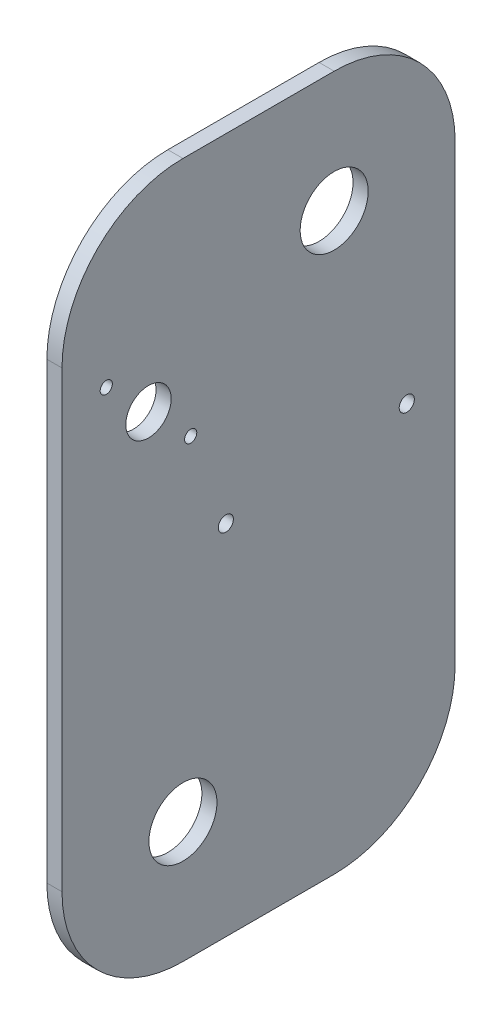
ISO-10303-21;
HEADER;
FILE_DESCRIPTION(('STEP AP214'),'2;1');
FILE_NAME('part.step','',(''),(''),'','','');
FILE_SCHEMA(('AUTOMOTIVE_DESIGN { 1 0 10303 214 1 1 1 1 }'));
ENDSEC;
DATA;
#1=APPLICATION_CONTEXT('core data for automotive mechanical design processes');
#2=APPLICATION_PROTOCOL_DEFINITION('international standard','automotive_design',2000,#1);
#3=PRODUCT_CONTEXT('',#1,'mechanical');
#4=PRODUCT('Part','Part','',(#3));
#5=PRODUCT_RELATED_PRODUCT_CATEGORY('part','',(#4));
#6=PRODUCT_DEFINITION_FORMATION('','',#4);
#7=PRODUCT_DEFINITION_CONTEXT('part definition',#1,'design');
#8=PRODUCT_DEFINITION('design','',#6,#7);
#9=PRODUCT_DEFINITION_SHAPE('','',#8);
#10=(LENGTH_UNIT() NAMED_UNIT(*) SI_UNIT(.MILLI.,.METRE.));
#11=(NAMED_UNIT(*) PLANE_ANGLE_UNIT() SI_UNIT($,.RADIAN.));
#12=(NAMED_UNIT(*) SI_UNIT($,.STERADIAN.) SOLID_ANGLE_UNIT());
#13=UNCERTAINTY_MEASURE_WITH_UNIT(LENGTH_MEASURE(1.E-05),#10,'distance_accuracy_value','');
#14=(GEOMETRIC_REPRESENTATION_CONTEXT(3) GLOBAL_UNCERTAINTY_ASSIGNED_CONTEXT((#13)) GLOBAL_UNIT_ASSIGNED_CONTEXT((#10,
#11,#12)) REPRESENTATION_CONTEXT('',''));
#15=CARTESIAN_POINT('',(0.,0.,0.));
#16=DIRECTION('',(0.,0.,1.));
#17=DIRECTION('',(1.,0.,0.));
#18=AXIS2_PLACEMENT_3D('',#15,#16,#17);
#19=CARTESIAN_POINT('',(3.175,-146.05,-82.55));
#20=DIRECTION('',(0.,0.,1.));
#21=DIRECTION('',(1.,0.,0.));
#22=AXIS2_PLACEMENT_3D('',#19,#20,#21);
#23=PLANE('',#22);
#24=DIRECTION('',(0.,1.,0.));
#25=VECTOR('',#24,1.);
#26=CARTESIAN_POINT('',(3.175,-146.05,-82.55));
#27=LINE('',#26,#25);
#28=CARTESIAN_POINT('',(3.175,-95.25,-82.55));
#29=VERTEX_POINT('',#28);
#30=CARTESIAN_POINT('',(3.175,95.25,-82.55));
#31=VERTEX_POINT('',#30);
#32=EDGE_CURVE('E119',#29,#31,#27,.T.);
#33=ORIENTED_EDGE('',*,*,#32,.F.);
#34=DIRECTION('',(-1.,0.,0.));
#35=VECTOR('',#34,1.);
#36=CARTESIAN_POINT('',(3.175,-95.25,-82.55));
#37=LINE('',#36,#35);
#38=CARTESIAN_POINT('',(-3.175,-95.25,-82.55));
#39=VERTEX_POINT('',#38);
#40=EDGE_CURVE('E104',#29,#39,#37,.T.);
#41=ORIENTED_EDGE('',*,*,#40,.T.);
#42=DIRECTION('',(0.,1.,0.));
#43=VECTOR('',#42,1.);
#44=CARTESIAN_POINT('',(-3.175,-146.05,-82.55));
#45=LINE('',#44,#43);
#46=CARTESIAN_POINT('',(-3.175,95.25,-82.55));
#47=VERTEX_POINT('',#46);
#48=EDGE_CURVE('E116',#39,#47,#45,.T.);
#49=ORIENTED_EDGE('',*,*,#48,.T.);
#50=DIRECTION('',(-1.,0.,0.));
#51=VECTOR('',#50,1.);
#52=CARTESIAN_POINT('',(3.175,95.25,-82.55));
#53=LINE('',#52,#51);
#54=EDGE_CURVE('E121',#47,#31,#53,.F.);
#55=ORIENTED_EDGE('',*,*,#54,.T.);
#56=EDGE_LOOP('',(#33,#41,#49,#55));
#57=FACE_BOUND('',#56,.T.);
#58=ADVANCED_FACE('F34',(#57),#23,.F.);
#59=CARTESIAN_POINT('',(3.175,146.05,82.55));
#60=DIRECTION('',(0.,-1.,0.));
#61=DIRECTION('',(0.,0.,-1.));
#62=AXIS2_PLACEMENT_3D('',#59,#60,#61);
#63=PLANE('',#62);
#64=DIRECTION('',(0.,0.,1.));
#65=VECTOR('',#64,1.);
#66=CARTESIAN_POINT('',(3.175,146.05,82.55));
#67=LINE('',#66,#65);
#68=CARTESIAN_POINT('',(3.175,146.05,-31.75));
#69=VERTEX_POINT('',#68);
#70=CARTESIAN_POINT('',(3.175,146.05,31.75));
#71=VERTEX_POINT('',#70);
#72=EDGE_CURVE('E165',#69,#71,#67,.T.);
#73=ORIENTED_EDGE('',*,*,#72,.F.);
#74=DIRECTION('',(-1.,0.,0.));
#75=VECTOR('',#74,1.);
#76=CARTESIAN_POINT('',(3.175,146.05,-31.75));
#77=LINE('',#76,#75);
#78=CARTESIAN_POINT('',(-3.175,146.05,-31.75));
#79=VERTEX_POINT('',#78);
#80=EDGE_CURVE('E158',#69,#79,#77,.T.);
#81=ORIENTED_EDGE('',*,*,#80,.T.);
#82=DIRECTION('',(0.,0.,1.));
#83=VECTOR('',#82,1.);
#84=CARTESIAN_POINT('',(-3.175,146.05,82.55));
#85=LINE('',#84,#83);
#86=CARTESIAN_POINT('',(-3.175,146.05,31.75));
#87=VERTEX_POINT('',#86);
#88=EDGE_CURVE('E125',#79,#87,#85,.T.);
#89=ORIENTED_EDGE('',*,*,#88,.T.);
#90=DIRECTION('',(-1.,0.,0.));
#91=VECTOR('',#90,1.);
#92=CARTESIAN_POINT('',(3.175,146.05,31.75));
#93=LINE('',#92,#91);
#94=EDGE_CURVE('E156',#87,#71,#93,.F.);
#95=ORIENTED_EDGE('',*,*,#94,.T.);
#96=EDGE_LOOP('',(#73,#81,#89,#95));
#97=FACE_BOUND('',#96,.T.);
#98=ADVANCED_FACE('F163',(#97),#63,.F.);
#99=CARTESIAN_POINT('',(3.175,-146.05,82.55));
#100=DIRECTION('',(0.,0.,-1.));
#101=DIRECTION('',(-1.,0.,0.));
#102=AXIS2_PLACEMENT_3D('',#99,#100,#101);
#103=PLANE('',#102);
#104=DIRECTION('',(0.,-1.,0.));
#105=VECTOR('',#104,1.);
#106=CARTESIAN_POINT('',(3.175,-146.05,82.55));
#107=LINE('',#106,#105);
#108=CARTESIAN_POINT('',(3.175,95.25,82.55));
#109=VERTEX_POINT('',#108);
#110=CARTESIAN_POINT('',(3.175,-95.25,82.55));
#111=VERTEX_POINT('',#110);
#112=EDGE_CURVE('E173',#109,#111,#107,.T.);
#113=ORIENTED_EDGE('',*,*,#112,.F.);
#114=DIRECTION('',(-1.,0.,0.));
#115=VECTOR('',#114,1.);
#116=CARTESIAN_POINT('',(3.175,95.25,82.55));
#117=LINE('',#116,#115);
#118=CARTESIAN_POINT('',(-3.175,95.25,82.55));
#119=VERTEX_POINT('',#118);
#120=EDGE_CURVE('E11',#109,#119,#117,.T.);
#121=ORIENTED_EDGE('',*,*,#120,.T.);
#122=DIRECTION('',(0.,-1.,0.));
#123=VECTOR('',#122,1.);
#124=CARTESIAN_POINT('',(-3.175,-146.05,82.55));
#125=LINE('',#124,#123);
#126=CARTESIAN_POINT('',(-3.175,-95.25,82.55));
#127=VERTEX_POINT('',#126);
#128=EDGE_CURVE('E129',#119,#127,#125,.T.);
#129=ORIENTED_EDGE('',*,*,#128,.T.);
#130=DIRECTION('',(-1.,0.,0.));
#131=VECTOR('',#130,1.);
#132=CARTESIAN_POINT('',(3.175,-95.25,82.55));
#133=LINE('',#132,#131);
#134=EDGE_CURVE('E42',#127,#111,#133,.F.);
#135=ORIENTED_EDGE('',*,*,#134,.T.);
#136=EDGE_LOOP('',(#113,#121,#129,#135));
#137=FACE_BOUND('',#136,.T.);
#138=ADVANCED_FACE('F172',(#137),#103,.F.);
#139=CARTESIAN_POINT('',(3.175,-146.05,82.55));
#140=DIRECTION('',(0.,1.,0.));
#141=DIRECTION('',(0.,0.,1.));
#142=AXIS2_PLACEMENT_3D('',#139,#140,#141);
#143=PLANE('',#142);
#144=DIRECTION('',(0.,0.,-1.));
#145=VECTOR('',#144,1.);
#146=CARTESIAN_POINT('',(-3.175,-146.05,82.55));
#147=LINE('',#146,#145);
#148=CARTESIAN_POINT('',(-3.175,-146.05,31.75));
#149=VERTEX_POINT('',#148);
#150=CARTESIAN_POINT('',(-3.175,-146.05,-31.75));
#151=VERTEX_POINT('',#150);
#152=EDGE_CURVE('E139',#149,#151,#147,.T.);
#153=ORIENTED_EDGE('',*,*,#152,.T.);
#154=DIRECTION('',(-1.,0.,0.));
#155=VECTOR('',#154,1.);
#156=CARTESIAN_POINT('',(3.175,-146.05,-31.75));
#157=LINE('',#156,#155);
#158=CARTESIAN_POINT('',(3.175,-146.05,-31.75));
#159=VERTEX_POINT('',#158);
#160=EDGE_CURVE('E105',#151,#159,#157,.F.);
#161=ORIENTED_EDGE('',*,*,#160,.T.);
#162=DIRECTION('',(0.,0.,-1.));
#163=VECTOR('',#162,1.);
#164=CARTESIAN_POINT('',(3.175,-146.05,82.55));
#165=LINE('',#164,#163);
#166=CARTESIAN_POINT('',(3.175,-146.05,31.75));
#167=VERTEX_POINT('',#166);
#168=EDGE_CURVE('E135',#167,#159,#165,.T.);
#169=ORIENTED_EDGE('',*,*,#168,.F.);
#170=DIRECTION('',(-1.,0.,0.));
#171=VECTOR('',#170,1.);
#172=CARTESIAN_POINT('',(3.175,-146.05,31.75));
#173=LINE('',#172,#171);
#174=EDGE_CURVE('E110',#167,#149,#173,.T.);
#175=ORIENTED_EDGE('',*,*,#174,.T.);
#176=EDGE_LOOP('',(#153,#161,#169,#175));
#177=FACE_BOUND('',#176,.T.);
#178=ADVANCED_FACE('F317',(#177),#143,.F.);
#179=CARTESIAN_POINT('',(3.175,0.,0.));
#180=DIRECTION('',(-1.,0.,0.));
#181=DIRECTION('',(0.,0.,1.));
#182=AXIS2_PLACEMENT_3D('',#179,#180,#181);
#183=PLANE('',#182);
#184=CARTESIAN_POINT('',(3.175,43.4336309512017,28.500964373605));
#185=DIRECTION('',(-1.,0.,0.));
#186=DIRECTION('',(0.,0.,1.));
#187=AXIS2_PLACEMENT_3D('',#184,#185,#186);
#188=CIRCLE('',#187,2.5527);
#189=CARTESIAN_POINT('',(3.175,43.4336309512017,31.053664373605));
#190=VERTEX_POINT('',#189);
#191=EDGE_CURVE('E209',#190,#190,#188,.T.);
#192=ORIENTED_EDGE('',*,*,#191,.T.);
#193=EDGE_LOOP('',(#192));
#194=FACE_BOUND('',#193,.T.);
#195=CARTESIAN_POINT('',(3.175,78.8920309512017,63.959364373605));
#196=DIRECTION('',(-1.,0.,0.));
#197=DIRECTION('',(0.,0.,1.));
#198=AXIS2_PLACEMENT_3D('',#195,#196,#197);
#199=CIRCLE('',#198,2.55270000000003);
#200=CARTESIAN_POINT('',(3.175,78.8920309512017,66.512064373605));
#201=VERTEX_POINT('',#200);
#202=EDGE_CURVE('E203',#201,#201,#199,.T.);
#203=ORIENTED_EDGE('',*,*,#202,.T.);
#204=EDGE_LOOP('',(#203));
#205=FACE_BOUND('',#204,.T.);
#206=CARTESIAN_POINT('',(3.175,61.1628309512017,46.230164373605));
#207=DIRECTION('',(-1.,0.,0.));
#208=DIRECTION('',(0.,0.,1.));
#209=AXIS2_PLACEMENT_3D('',#206,#207,#208);
#210=CIRCLE('',#209,9.52500000000002);
#211=CARTESIAN_POINT('',(3.175,61.1628309512017,55.755164373605));
#212=VERTEX_POINT('',#211);
#213=EDGE_CURVE('E192',#212,#212,#210,.T.);
#214=ORIENTED_EDGE('',*,*,#213,.T.);
#215=EDGE_LOOP('',(#214));
#216=FACE_BOUND('',#215,.T.);
#217=CARTESIAN_POINT('',(3.175,9.91138566006685,-62.2417991108947));
#218=DIRECTION('',(1.,0.,0.));
#219=DIRECTION('',(0.,0.,-1.));
#220=AXIS2_PLACEMENT_3D('',#217,#218,#219);
#221=CIRCLE('',#220,3.17499999999998);
#222=CARTESIAN_POINT('',(3.175,9.91138566006685,-65.4167991108947));
#223=VERTEX_POINT('',#222);
#224=EDGE_CURVE('E195',#223,#223,#221,.T.);
#225=ORIENTED_EDGE('',*,*,#224,.F.);
#226=EDGE_LOOP('',(#225));
#227=FACE_BOUND('',#226,.T.);
#228=CARTESIAN_POINT('',(3.175,4.28894058069338,13.7504907041215));
#229=DIRECTION('',(1.,0.,0.));
#230=DIRECTION('',(0.,0.,-1.));
#231=AXIS2_PLACEMENT_3D('',#228,#229,#230);
#232=CIRCLE('',#231,3.17499999999998);
#233=CARTESIAN_POINT('',(3.175,4.28894058069338,10.5754907041216));
#234=VERTEX_POINT('',#233);
#235=EDGE_CURVE('E188',#234,#234,#232,.T.);
#236=ORIENTED_EDGE('',*,*,#235,.F.);
#237=EDGE_LOOP('',(#236));
#238=FACE_BOUND('',#237,.T.);
#239=CARTESIAN_POINT('',(3.175,-95.25,31.75));
#240=DIRECTION('',(-1.,0.,0.));
#241=DIRECTION('',(0.,0.,1.));
#242=AXIS2_PLACEMENT_3D('',#239,#240,#241);
#243=CIRCLE('',#242,14.2875);
#244=CARTESIAN_POINT('',(3.175,-95.25,46.0375));
#245=VERTEX_POINT('',#244);
#246=EDGE_CURVE('E126',#245,#245,#243,.T.);
#247=ORIENTED_EDGE('',*,*,#246,.T.);
#248=EDGE_LOOP('',(#247));
#249=FACE_BOUND('',#248,.T.);
#250=CARTESIAN_POINT('',(3.175,95.25,-31.75));
#251=DIRECTION('',(-1.,0.,0.));
#252=DIRECTION('',(0.,0.,1.));
#253=AXIS2_PLACEMENT_3D('',#250,#251,#252);
#254=CIRCLE('',#253,14.2875);
#255=CARTESIAN_POINT('',(3.175,95.25,-17.4625));
#256=VERTEX_POINT('',#255);
#257=EDGE_CURVE('E182',#256,#256,#254,.T.);
#258=ORIENTED_EDGE('',*,*,#257,.T.);
#259=EDGE_LOOP('',(#258));
#260=FACE_BOUND('',#259,.T.);
#261=ORIENTED_EDGE('',*,*,#168,.T.);
#262=CARTESIAN_POINT('',(3.175,-95.25,-31.75));
#263=DIRECTION('',(-1.,0.,0.));
#264=DIRECTION('',(0.,0.,1.));
#265=AXIS2_PLACEMENT_3D('',#262,#263,#264);
#266=CIRCLE('',#265,50.8);
#267=EDGE_CURVE('E154',#159,#29,#266,.F.);
#268=ORIENTED_EDGE('',*,*,#267,.T.);
#269=ORIENTED_EDGE('',*,*,#32,.T.);
#270=CARTESIAN_POINT('',(3.175,95.25,-31.75));
#271=DIRECTION('',(-1.,0.,0.));
#272=DIRECTION('',(0.,0.,1.));
#273=AXIS2_PLACEMENT_3D('',#270,#271,#272);
#274=CIRCLE('',#273,50.8);
#275=EDGE_CURVE('E152',#31,#69,#274,.F.);
#276=ORIENTED_EDGE('',*,*,#275,.T.);
#277=ORIENTED_EDGE('',*,*,#72,.T.);
#278=CARTESIAN_POINT('',(3.175,95.25,31.75));
#279=DIRECTION('',(-1.,0.,0.));
#280=DIRECTION('',(0.,0.,1.));
#281=AXIS2_PLACEMENT_3D('',#278,#279,#280);
#282=CIRCLE('',#281,50.8);
#283=EDGE_CURVE('E55',#71,#109,#282,.F.);
#284=ORIENTED_EDGE('',*,*,#283,.T.);
#285=ORIENTED_EDGE('',*,*,#112,.T.);
#286=CARTESIAN_POINT('',(3.175,-95.25,31.75));
#287=DIRECTION('',(-1.,0.,0.));
#288=DIRECTION('',(0.,0.,1.));
#289=AXIS2_PLACEMENT_3D('',#286,#287,#288);
#290=CIRCLE('',#289,50.8);
#291=EDGE_CURVE('E149',#111,#167,#290,.F.);
#292=ORIENTED_EDGE('',*,*,#291,.T.);
#293=EDGE_LOOP('',(#261,#268,#269,#276,#277,#284,#285,#292));
#294=FACE_BOUND('',#293,.T.);
#295=ADVANCED_FACE('F218',(#194,#205,#216,#227,#238,#249,#260,#294),#183,.F.);
#296=CARTESIAN_POINT('',(-3.175,0.,0.));
#297=DIRECTION('',(-1.,0.,0.));
#298=DIRECTION('',(0.,0.,1.));
#299=AXIS2_PLACEMENT_3D('',#296,#297,#298);
#300=PLANE('',#299);
#301=CARTESIAN_POINT('',(-3.175,43.4336309512017,28.500964373605));
#302=DIRECTION('',(-1.,0.,0.));
#303=DIRECTION('',(0.,0.,1.));
#304=AXIS2_PLACEMENT_3D('',#301,#302,#303);
#305=CIRCLE('',#304,2.5527);
#306=CARTESIAN_POINT('',(-3.175,43.4336309512017,31.053664373605));
#307=VERTEX_POINT('',#306);
#308=EDGE_CURVE('E206',#307,#307,#305,.T.);
#309=ORIENTED_EDGE('',*,*,#308,.F.);
#310=EDGE_LOOP('',(#309));
#311=FACE_BOUND('',#310,.T.);
#312=CARTESIAN_POINT('',(-3.175,78.8920309512017,63.959364373605));
#313=DIRECTION('',(-1.,0.,0.));
#314=DIRECTION('',(0.,0.,1.));
#315=AXIS2_PLACEMENT_3D('',#312,#313,#314);
#316=CIRCLE('',#315,2.55270000000003);
#317=CARTESIAN_POINT('',(-3.175,78.8920309512017,66.512064373605));
#318=VERTEX_POINT('',#317);
#319=EDGE_CURVE('E212',#318,#318,#316,.T.);
#320=ORIENTED_EDGE('',*,*,#319,.F.);
#321=EDGE_LOOP('',(#320));
#322=FACE_BOUND('',#321,.T.);
#323=CARTESIAN_POINT('',(-3.175,61.1628309512017,46.230164373605));
#324=DIRECTION('',(-1.,0.,0.));
#325=DIRECTION('',(0.,0.,1.));
#326=AXIS2_PLACEMENT_3D('',#323,#324,#325);
#327=CIRCLE('',#326,9.52500000000002);
#328=CARTESIAN_POINT('',(-3.175,61.1628309512017,55.755164373605));
#329=VERTEX_POINT('',#328);
#330=EDGE_CURVE('E200',#329,#329,#327,.T.);
#331=ORIENTED_EDGE('',*,*,#330,.F.);
#332=EDGE_LOOP('',(#331));
#333=FACE_BOUND('',#332,.T.);
#334=CARTESIAN_POINT('',(-3.175,9.91138566006685,-62.2417991108947));
#335=DIRECTION('',(1.,0.,0.));
#336=DIRECTION('',(0.,0.,-1.));
#337=AXIS2_PLACEMENT_3D('',#334,#335,#336);
#338=CIRCLE('',#337,3.17499999999998);
#339=CARTESIAN_POINT('',(-3.175,9.91138566006685,-65.4167991108947));
#340=VERTEX_POINT('',#339);
#341=EDGE_CURVE('E183',#340,#340,#338,.T.);
#342=ORIENTED_EDGE('',*,*,#341,.T.);
#343=EDGE_LOOP('',(#342));
#344=FACE_BOUND('',#343,.T.);
#345=CARTESIAN_POINT('',(-3.175,4.28894058069338,13.7504907041215));
#346=DIRECTION('',(1.,0.,0.));
#347=DIRECTION('',(0.,0.,-1.));
#348=AXIS2_PLACEMENT_3D('',#345,#346,#347);
#349=CIRCLE('',#348,3.17499999999998);
#350=CARTESIAN_POINT('',(-3.175,4.28894058069338,10.5754907041216));
#351=VERTEX_POINT('',#350);
#352=EDGE_CURVE('E191',#351,#351,#349,.T.);
#353=ORIENTED_EDGE('',*,*,#352,.T.);
#354=EDGE_LOOP('',(#353));
#355=FACE_BOUND('',#354,.T.);
#356=CARTESIAN_POINT('',(-3.175,-95.25,31.75));
#357=DIRECTION('',(-1.,0.,0.));
#358=DIRECTION('',(0.,0.,1.));
#359=AXIS2_PLACEMENT_3D('',#356,#357,#358);
#360=CIRCLE('',#359,14.2875);
#361=CARTESIAN_POINT('',(-3.175,-95.25,46.0375));
#362=VERTEX_POINT('',#361);
#363=EDGE_CURVE('E132',#362,#362,#360,.T.);
#364=ORIENTED_EDGE('',*,*,#363,.F.);
#365=EDGE_LOOP('',(#364));
#366=FACE_BOUND('',#365,.T.);
#367=CARTESIAN_POINT('',(-3.175,95.25,-31.75));
#368=DIRECTION('',(-1.,0.,0.));
#369=DIRECTION('',(0.,0.,1.));
#370=AXIS2_PLACEMENT_3D('',#367,#368,#369);
#371=CIRCLE('',#370,14.2875);
#372=CARTESIAN_POINT('',(-3.175,95.25,-17.4625));
#373=VERTEX_POINT('',#372);
#374=EDGE_CURVE('E179',#373,#373,#371,.T.);
#375=ORIENTED_EDGE('',*,*,#374,.F.);
#376=EDGE_LOOP('',(#375));
#377=FACE_BOUND('',#376,.T.);
#378=ORIENTED_EDGE('',*,*,#48,.F.);
#379=CARTESIAN_POINT('',(-3.175,-95.25,-31.75));
#380=DIRECTION('',(-1.,0.,0.));
#381=DIRECTION('',(0.,0.,1.));
#382=AXIS2_PLACEMENT_3D('',#379,#380,#381);
#383=CIRCLE('',#382,50.8);
#384=EDGE_CURVE('E100',#39,#151,#383,.T.);
#385=ORIENTED_EDGE('',*,*,#384,.T.);
#386=ORIENTED_EDGE('',*,*,#152,.F.);
#387=CARTESIAN_POINT('',(-3.175,-95.25,31.75));
#388=DIRECTION('',(-1.,0.,0.));
#389=DIRECTION('',(0.,0.,1.));
#390=AXIS2_PLACEMENT_3D('',#387,#388,#389);
#391=CIRCLE('',#390,50.8);
#392=EDGE_CURVE('E120',#149,#127,#391,.T.);
#393=ORIENTED_EDGE('',*,*,#392,.T.);
#394=ORIENTED_EDGE('',*,*,#128,.F.);
#395=CARTESIAN_POINT('',(-3.175,95.25,31.75));
#396=DIRECTION('',(-1.,0.,0.));
#397=DIRECTION('',(0.,0.,1.));
#398=AXIS2_PLACEMENT_3D('',#395,#396,#397);
#399=CIRCLE('',#398,50.8);
#400=EDGE_CURVE('E143',#119,#87,#399,.T.);
#401=ORIENTED_EDGE('',*,*,#400,.T.);
#402=ORIENTED_EDGE('',*,*,#88,.F.);
#403=CARTESIAN_POINT('',(-3.175,95.25,-31.75));
#404=DIRECTION('',(-1.,0.,0.));
#405=DIRECTION('',(0.,0.,1.));
#406=AXIS2_PLACEMENT_3D('',#403,#404,#405);
#407=CIRCLE('',#406,50.8);
#408=EDGE_CURVE('E111',#79,#47,#407,.T.);
#409=ORIENTED_EDGE('',*,*,#408,.T.);
#410=EDGE_LOOP('',(#378,#385,#386,#393,#394,#401,#402,#409));
#411=FACE_BOUND('',#410,.T.);
#412=ADVANCED_FACE('F123',(#311,#322,#333,#344,#355,#366,#377,#411),#300,.T.);
#413=CARTESIAN_POINT('',(3.175,-95.25,-31.75));
#414=DIRECTION('',(-1.,0.,0.));
#415=DIRECTION('',(0.,0.,1.));
#416=AXIS2_PLACEMENT_3D('',#413,#414,#415);
#417=CYLINDRICAL_SURFACE('',#416,50.8);
#418=ORIENTED_EDGE('',*,*,#267,.F.);
#419=ORIENTED_EDGE('',*,*,#160,.F.);
#420=ORIENTED_EDGE('',*,*,#384,.F.);
#421=ORIENTED_EDGE('',*,*,#40,.F.);
#422=EDGE_LOOP('',(#418,#419,#420,#421));
#423=FACE_BOUND('',#422,.T.);
#424=ADVANCED_FACE('F103',(#423),#417,.T.);
#425=CARTESIAN_POINT('',(3.175,95.25,-31.75));
#426=DIRECTION('',(-1.,0.,0.));
#427=DIRECTION('',(0.,0.,1.));
#428=AXIS2_PLACEMENT_3D('',#425,#426,#427);
#429=CYLINDRICAL_SURFACE('',#428,50.8);
#430=ORIENTED_EDGE('',*,*,#275,.F.);
#431=ORIENTED_EDGE('',*,*,#54,.F.);
#432=ORIENTED_EDGE('',*,*,#408,.F.);
#433=ORIENTED_EDGE('',*,*,#80,.F.);
#434=EDGE_LOOP('',(#430,#431,#432,#433));
#435=FACE_BOUND('',#434,.T.);
#436=ADVANCED_FACE('F268',(#435),#429,.T.);
#437=CARTESIAN_POINT('',(3.175,95.25,31.75));
#438=DIRECTION('',(-1.,0.,0.));
#439=DIRECTION('',(0.,0.,1.));
#440=AXIS2_PLACEMENT_3D('',#437,#438,#439);
#441=CYLINDRICAL_SURFACE('',#440,50.8);
#442=ORIENTED_EDGE('',*,*,#283,.F.);
#443=ORIENTED_EDGE('',*,*,#94,.F.);
#444=ORIENTED_EDGE('',*,*,#400,.F.);
#445=ORIENTED_EDGE('',*,*,#120,.F.);
#446=EDGE_LOOP('',(#442,#443,#444,#445));
#447=FACE_BOUND('',#446,.T.);
#448=ADVANCED_FACE('F171',(#447),#441,.T.);
#449=CARTESIAN_POINT('',(3.175,-95.25,31.75));
#450=DIRECTION('',(-1.,0.,0.));
#451=DIRECTION('',(0.,0.,1.));
#452=AXIS2_PLACEMENT_3D('',#449,#450,#451);
#453=CYLINDRICAL_SURFACE('',#452,50.8);
#454=ORIENTED_EDGE('',*,*,#291,.F.);
#455=ORIENTED_EDGE('',*,*,#134,.F.);
#456=ORIENTED_EDGE('',*,*,#392,.F.);
#457=ORIENTED_EDGE('',*,*,#174,.F.);
#458=EDGE_LOOP('',(#454,#455,#456,#457));
#459=FACE_BOUND('',#458,.T.);
#460=ADVANCED_FACE('F36',(#459),#453,.T.);
#461=CARTESIAN_POINT('',(3.175,95.25,-31.75));
#462=DIRECTION('',(-1.,0.,0.));
#463=DIRECTION('',(0.,0.,1.));
#464=AXIS2_PLACEMENT_3D('',#461,#462,#463);
#465=CYLINDRICAL_SURFACE('',#464,14.2875);
#466=ORIENTED_EDGE('',*,*,#257,.F.);
#467=EDGE_LOOP('',(#466));
#468=FACE_BOUND('',#467,.T.);
#469=ORIENTED_EDGE('',*,*,#374,.T.);
#470=EDGE_LOOP('',(#469));
#471=FACE_BOUND('',#470,.T.);
#472=ADVANCED_FACE('F243',(#468,#471),#465,.F.);
#473=CARTESIAN_POINT('',(3.175,-95.25,31.75));
#474=DIRECTION('',(-1.,0.,0.));
#475=DIRECTION('',(0.,0.,1.));
#476=AXIS2_PLACEMENT_3D('',#473,#474,#475);
#477=CYLINDRICAL_SURFACE('',#476,14.2875);
#478=ORIENTED_EDGE('',*,*,#246,.F.);
#479=EDGE_LOOP('',(#478));
#480=FACE_BOUND('',#479,.T.);
#481=ORIENTED_EDGE('',*,*,#363,.T.);
#482=EDGE_LOOP('',(#481));
#483=FACE_BOUND('',#482,.T.);
#484=ADVANCED_FACE('F245',(#480,#483),#477,.F.);
#485=CARTESIAN_POINT('',(-3.175,4.28894058069338,13.7504907041215));
#486=DIRECTION('',(1.,0.,0.));
#487=DIRECTION('',(0.,0.,-1.));
#488=AXIS2_PLACEMENT_3D('',#485,#486,#487);
#489=CYLINDRICAL_SURFACE('',#488,3.17499999999998);
#490=ORIENTED_EDGE('',*,*,#352,.F.);
#491=EDGE_LOOP('',(#490));
#492=FACE_BOUND('',#491,.T.);
#493=ORIENTED_EDGE('',*,*,#235,.T.);
#494=EDGE_LOOP('',(#493));
#495=FACE_BOUND('',#494,.T.);
#496=ADVANCED_FACE('F252',(#492,#495),#489,.F.);
#497=CARTESIAN_POINT('',(-3.175,9.91138566006685,-62.2417991108947));
#498=DIRECTION('',(1.,0.,0.));
#499=DIRECTION('',(0.,0.,-1.));
#500=AXIS2_PLACEMENT_3D('',#497,#498,#499);
#501=CYLINDRICAL_SURFACE('',#500,3.17499999999998);
#502=ORIENTED_EDGE('',*,*,#341,.F.);
#503=EDGE_LOOP('',(#502));
#504=FACE_BOUND('',#503,.T.);
#505=ORIENTED_EDGE('',*,*,#224,.T.);
#506=EDGE_LOOP('',(#505));
#507=FACE_BOUND('',#506,.T.);
#508=ADVANCED_FACE('F298',(#504,#507),#501,.F.);
#509=CARTESIAN_POINT('',(3.175,61.1628309512017,46.230164373605));
#510=DIRECTION('',(-1.,0.,0.));
#511=DIRECTION('',(0.,0.,1.));
#512=AXIS2_PLACEMENT_3D('',#509,#510,#511);
#513=CYLINDRICAL_SURFACE('',#512,9.52500000000002);
#514=ORIENTED_EDGE('',*,*,#213,.F.);
#515=EDGE_LOOP('',(#514));
#516=FACE_BOUND('',#515,.T.);
#517=ORIENTED_EDGE('',*,*,#330,.T.);
#518=EDGE_LOOP('',(#517));
#519=FACE_BOUND('',#518,.T.);
#520=ADVANCED_FACE('F225',(#516,#519),#513,.F.);
#521=CARTESIAN_POINT('',(3.175,78.8920309512017,63.959364373605));
#522=DIRECTION('',(-1.,0.,0.));
#523=DIRECTION('',(0.,0.,1.));
#524=AXIS2_PLACEMENT_3D('',#521,#522,#523);
#525=CYLINDRICAL_SURFACE('',#524,2.55270000000003);
#526=ORIENTED_EDGE('',*,*,#202,.F.);
#527=EDGE_LOOP('',(#526));
#528=FACE_BOUND('',#527,.T.);
#529=ORIENTED_EDGE('',*,*,#319,.T.);
#530=EDGE_LOOP('',(#529));
#531=FACE_BOUND('',#530,.T.);
#532=ADVANCED_FACE('F221',(#528,#531),#525,.F.);
#533=CARTESIAN_POINT('',(3.175,43.4336309512017,28.500964373605));
#534=DIRECTION('',(-1.,0.,0.));
#535=DIRECTION('',(0.,0.,1.));
#536=AXIS2_PLACEMENT_3D('',#533,#534,#535);
#537=CYLINDRICAL_SURFACE('',#536,2.5527);
#538=ORIENTED_EDGE('',*,*,#191,.F.);
#539=EDGE_LOOP('',(#538));
#540=FACE_BOUND('',#539,.T.);
#541=ORIENTED_EDGE('',*,*,#308,.T.);
#542=EDGE_LOOP('',(#541));
#543=FACE_BOUND('',#542,.T.);
#544=ADVANCED_FACE('F224',(#540,#543),#537,.F.);
#545=CLOSED_SHELL('',(#58,#98,#138,#178,#295,#412,#424,#436,#448,#460,#472,#484,#496,#508,#520,
#532,#544));
#546=MANIFOLD_SOLID_BREP('B2',#545);
#547=ADVANCED_BREP_SHAPE_REPRESENTATION('',(#18,#546),#14);
#548=SHAPE_DEFINITION_REPRESENTATION(#9,#547);
ENDSEC;
END-ISO-10303-21;
